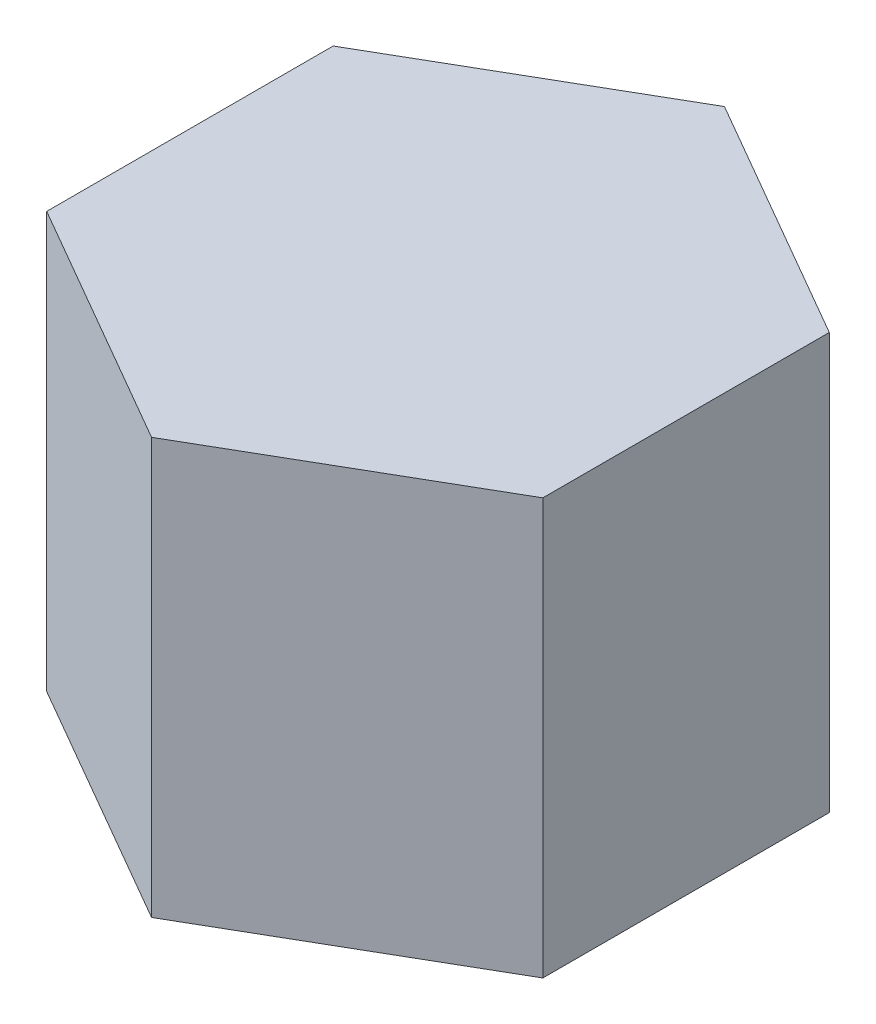
ISO-10303-21;
HEADER;
FILE_DESCRIPTION(('STEP AP214'),'2;1');
FILE_NAME('part.step','',(''),(''),'','','');
FILE_SCHEMA(('AUTOMOTIVE_DESIGN { 1 0 10303 214 1 1 1 1 }'));
ENDSEC;
DATA;
#1=APPLICATION_CONTEXT('core data for automotive mechanical design processes');
#2=APPLICATION_PROTOCOL_DEFINITION('international standard','automotive_design',2000,#1);
#3=PRODUCT_CONTEXT('',#1,'mechanical');
#4=PRODUCT('Part','Part','',(#3));
#5=PRODUCT_RELATED_PRODUCT_CATEGORY('part','',(#4));
#6=PRODUCT_DEFINITION_FORMATION('','',#4);
#7=PRODUCT_DEFINITION_CONTEXT('part definition',#1,'design');
#8=PRODUCT_DEFINITION('design','',#6,#7);
#9=PRODUCT_DEFINITION_SHAPE('','',#8);
#10=(LENGTH_UNIT() NAMED_UNIT(*) SI_UNIT(.MILLI.,.METRE.));
#11=(NAMED_UNIT(*) PLANE_ANGLE_UNIT() SI_UNIT($,.RADIAN.));
#12=(NAMED_UNIT(*) SI_UNIT($,.STERADIAN.) SOLID_ANGLE_UNIT());
#13=UNCERTAINTY_MEASURE_WITH_UNIT(LENGTH_MEASURE(1.E-05),#10,'distance_accuracy_value','');
#14=(GEOMETRIC_REPRESENTATION_CONTEXT(3) GLOBAL_UNCERTAINTY_ASSIGNED_CONTEXT((#13)) GLOBAL_UNIT_ASSIGNED_CONTEXT((#10,
#11,#12)) REPRESENTATION_CONTEXT('',''));
#15=CARTESIAN_POINT('',(0.,0.,0.));
#16=DIRECTION('',(0.,0.,1.));
#17=DIRECTION('',(1.,0.,0.));
#18=AXIS2_PLACEMENT_3D('',#15,#16,#17);
#19=CARTESIAN_POINT('',(206.642660308706,-148.537700895744,291.506971220494));
#20=DIRECTION('',(-0.499999999999943,0.,-0.866025403784472));
#21=DIRECTION('',(-0.866025403784472,0.,0.499999999999943));
#22=AXIS2_PLACEMENT_3D('',#19,#20,#21);
#23=PLANE('',#22);
#24=CARTESIAN_POINT('',(206.339551417382,-149.045793579175,291.681971220494));
#25=DIRECTION('',(0.866025403784471,0.,-0.499999999999943));
#26=VECTOR('',#25,1.);
#27=LINE('',#24,#26);
#28=CARTESIAN_POINT('',(206.339551417382,-149.045793579175,291.681971220494));
#29=VERTEX_POINT('',#28);
#30=CARTESIAN_POINT('',(206.642660308706,-149.045793579175,291.506971220494));
#31=VERTEX_POINT('',#30);
#32=EDGE_CURVE('E170',#29,#31,#27,.T.);
#33=ORIENTED_EDGE('',*,*,#32,.T.);
#34=CARTESIAN_POINT('',(206.642660308706,-148.537700895744,291.506971220494));
#35=DIRECTION('',(0.,-1.,0.));
#36=VECTOR('',#35,1.);
#37=LINE('',#34,#36);
#38=CARTESIAN_POINT('',(206.642660308706,-148.537700895744,291.506971220494));
#39=VERTEX_POINT('',#38);
#40=EDGE_CURVE('E35',#39,#31,#37,.T.);
#41=ORIENTED_EDGE('',*,*,#40,.F.);
#42=CARTESIAN_POINT('',(206.339551417382,-148.537700895744,291.681971220494));
#43=DIRECTION('',(0.866025403784471,0.,-0.499999999999943));
#44=VECTOR('',#43,1.);
#45=LINE('',#42,#44);
#46=CARTESIAN_POINT('',(206.339551417382,-148.537700895744,291.681971220494));
#47=VERTEX_POINT('',#46);
#48=EDGE_CURVE('E159',#47,#39,#45,.T.);
#49=ORIENTED_EDGE('',*,*,#48,.F.);
#50=CARTESIAN_POINT('',(206.339551417382,-148.537700895744,291.681971220494));
#51=DIRECTION('',(0.,-1.,0.));
#52=VECTOR('',#51,1.);
#53=LINE('',#50,#52);
#54=EDGE_CURVE('E10',#47,#29,#53,.T.);
#55=ORIENTED_EDGE('',*,*,#54,.T.);
#56=EDGE_LOOP('',(#33,#41,#49,#55));
#57=FACE_BOUND('',#56,.T.);
#58=ADVANCED_FACE('F16',(#57),#23,.F.);
#59=CARTESIAN_POINT('',(206.339551417382,-148.537700895744,291.681971220494));
#60=DIRECTION('',(0.499999999999943,0.,-0.866025403784472));
#61=DIRECTION('',(-0.866025403784472,0.,-0.499999999999943));
#62=AXIS2_PLACEMENT_3D('',#59,#60,#61);
#63=PLANE('',#62);
#64=CARTESIAN_POINT('',(206.036442526057,-149.045793579175,291.506971220494));
#65=DIRECTION('',(0.866025403784471,0.,0.499999999999943));
#66=VECTOR('',#65,1.);
#67=LINE('',#64,#66);
#68=CARTESIAN_POINT('',(206.036442526057,-149.045793579175,291.506971220494));
#69=VERTEX_POINT('',#68);
#70=EDGE_CURVE('E167',#69,#29,#67,.T.);
#71=ORIENTED_EDGE('',*,*,#70,.T.);
#72=ORIENTED_EDGE('',*,*,#54,.F.);
#73=CARTESIAN_POINT('',(206.036442526057,-148.537700895744,291.506971220494));
#74=DIRECTION('',(0.866025403784471,0.,0.499999999999943));
#75=VECTOR('',#74,1.);
#76=LINE('',#73,#75);
#77=CARTESIAN_POINT('',(206.036442526057,-148.537700895744,291.506971220494));
#78=VERTEX_POINT('',#77);
#79=EDGE_CURVE('E156',#78,#47,#76,.T.);
#80=ORIENTED_EDGE('',*,*,#79,.F.);
#81=CARTESIAN_POINT('',(206.036442526057,-148.537700895744,291.506971220494));
#82=DIRECTION('',(0.,-1.,0.));
#83=VECTOR('',#82,1.);
#84=LINE('',#81,#83);
#85=EDGE_CURVE('E27',#78,#69,#84,.T.);
#86=ORIENTED_EDGE('',*,*,#85,.T.);
#87=EDGE_LOOP('',(#71,#72,#80,#86));
#88=FACE_BOUND('',#87,.T.);
#89=ADVANCED_FACE('F189',(#88),#63,.F.);
#90=CARTESIAN_POINT('',(206.036442526057,-148.537700895744,290.831971220494));
#91=DIRECTION('',(1.,0.,0.));
#92=DIRECTION('',(0.,1.,0.));
#93=AXIS2_PLACEMENT_3D('',#90,#91,#92);
#94=PLANE('',#93);
#95=CARTESIAN_POINT('',(206.036442526057,-149.045793579175,291.156971220494));
#96=DIRECTION('',(0.,0.,1.));
#97=VECTOR('',#96,1.);
#98=LINE('',#95,#97);
#99=CARTESIAN_POINT('',(206.036442526057,-149.045793579175,291.156971220494));
#100=VERTEX_POINT('',#99);
#101=EDGE_CURVE('E163',#100,#69,#98,.T.);
#102=ORIENTED_EDGE('',*,*,#101,.T.);
#103=ORIENTED_EDGE('',*,*,#85,.F.);
#104=CARTESIAN_POINT('',(206.036442526057,-148.537700895744,291.156971220494));
#105=DIRECTION('',(0.,0.,1.));
#106=VECTOR('',#105,1.);
#107=LINE('',#104,#106);
#108=CARTESIAN_POINT('',(206.036442526057,-148.537700895744,291.156971220494));
#109=VERTEX_POINT('',#108);
#110=EDGE_CURVE('E106',#109,#78,#107,.T.);
#111=ORIENTED_EDGE('',*,*,#110,.F.);
#112=CARTESIAN_POINT('',(206.036442526057,-148.537700895744,291.156971220494));
#113=DIRECTION('',(0.,-1.,0.));
#114=VECTOR('',#113,1.);
#115=LINE('',#112,#114);
#116=EDGE_CURVE('E94',#109,#100,#115,.T.);
#117=ORIENTED_EDGE('',*,*,#116,.T.);
#118=EDGE_LOOP('',(#102,#103,#111,#117));
#119=FACE_BOUND('',#118,.T.);
#120=ADVANCED_FACE('F198',(#119),#94,.F.);
#121=CARTESIAN_POINT('',(206.036442526057,-148.537700895744,291.156971220494));
#122=DIRECTION('',(0.499999999999943,0.,0.866025403784472));
#123=DIRECTION('',(0.866025403784472,0.,-0.499999999999943));
#124=AXIS2_PLACEMENT_3D('',#121,#122,#123);
#125=PLANE('',#124);
#126=CARTESIAN_POINT('',(206.339551417382,-149.045793579175,290.981971220494));
#127=DIRECTION('',(-0.866025403784471,0.,0.499999999999943));
#128=VECTOR('',#127,1.);
#129=LINE('',#126,#128);
#130=CARTESIAN_POINT('',(206.339551417382,-149.045793579175,290.981971220494));
#131=VERTEX_POINT('',#130);
#132=EDGE_CURVE('E162',#131,#100,#129,.T.);
#133=ORIENTED_EDGE('',*,*,#132,.T.);
#134=ORIENTED_EDGE('',*,*,#116,.F.);
#135=CARTESIAN_POINT('',(206.339551417382,-148.537700895744,290.981971220494));
#136=DIRECTION('',(-0.866025403784471,0.,0.499999999999943));
#137=VECTOR('',#136,1.);
#138=LINE('',#135,#137);
#139=CARTESIAN_POINT('',(206.339551417382,-148.537700895744,290.981971220494));
#140=VERTEX_POINT('',#139);
#141=EDGE_CURVE('E98',#140,#109,#138,.T.);
#142=ORIENTED_EDGE('',*,*,#141,.F.);
#143=CARTESIAN_POINT('',(206.339551417382,-148.537700895744,290.981971220494));
#144=DIRECTION('',(0.,-1.,0.));
#145=VECTOR('',#144,1.);
#146=LINE('',#143,#145);
#147=EDGE_CURVE('E79',#140,#131,#146,.T.);
#148=ORIENTED_EDGE('',*,*,#147,.T.);
#149=EDGE_LOOP('',(#133,#134,#142,#148));
#150=FACE_BOUND('',#149,.T.);
#151=ADVANCED_FACE('F100',(#150),#125,.F.);
#152=CARTESIAN_POINT('',(206.339551417382,-148.537700895744,290.981971220494));
#153=DIRECTION('',(-0.500000000000062,0.,0.866025403784403));
#154=DIRECTION('',(0.866025403784403,0.,0.500000000000062));
#155=AXIS2_PLACEMENT_3D('',#152,#153,#154);
#156=PLANE('',#155);
#157=CARTESIAN_POINT('',(206.642660308706,-149.045793579175,291.156971220494));
#158=DIRECTION('',(-0.866025403784403,0.,-0.500000000000062));
#159=VECTOR('',#158,1.);
#160=LINE('',#157,#159);
#161=CARTESIAN_POINT('',(206.642660308706,-149.045793579175,291.156971220494));
#162=VERTEX_POINT('',#161);
#163=EDGE_CURVE('E88',#162,#131,#160,.T.);
#164=ORIENTED_EDGE('',*,*,#163,.T.);
#165=ORIENTED_EDGE('',*,*,#147,.F.);
#166=CARTESIAN_POINT('',(206.642660308706,-148.537700895744,291.156971220494));
#167=DIRECTION('',(-0.866025403784403,0.,-0.500000000000062));
#168=VECTOR('',#167,1.);
#169=LINE('',#166,#168);
#170=CARTESIAN_POINT('',(206.642660308706,-148.537700895744,291.156971220494));
#171=VERTEX_POINT('',#170);
#172=EDGE_CURVE('E84',#171,#140,#169,.T.);
#173=ORIENTED_EDGE('',*,*,#172,.F.);
#174=CARTESIAN_POINT('',(206.642660308706,-148.537700895744,291.156971220494));
#175=DIRECTION('',(0.,-1.,0.));
#176=VECTOR('',#175,1.);
#177=LINE('',#174,#176);
#178=EDGE_CURVE('E58',#171,#162,#177,.T.);
#179=ORIENTED_EDGE('',*,*,#178,.T.);
#180=EDGE_LOOP('',(#164,#165,#173,#179));
#181=FACE_BOUND('',#180,.T.);
#182=ADVANCED_FACE('F82',(#181),#156,.F.);
#183=CARTESIAN_POINT('',(206.642660308706,-148.537700895744,290.831971220494));
#184=DIRECTION('',(-1.,0.,0.));
#185=DIRECTION('',(0.,-1.,0.));
#186=AXIS2_PLACEMENT_3D('',#183,#184,#185);
#187=PLANE('',#186);
#188=CARTESIAN_POINT('',(206.642660308706,-149.045793579175,291.506971220494));
#189=DIRECTION('',(0.,0.,-1.));
#190=VECTOR('',#189,1.);
#191=LINE('',#188,#190);
#192=EDGE_CURVE('E160',#31,#162,#191,.T.);
#193=ORIENTED_EDGE('',*,*,#192,.T.);
#194=ORIENTED_EDGE('',*,*,#178,.F.);
#195=CARTESIAN_POINT('',(206.642660308706,-148.537700895744,291.506971220494));
#196=DIRECTION('',(0.,0.,-1.));
#197=VECTOR('',#196,1.);
#198=LINE('',#195,#197);
#199=EDGE_CURVE('E112',#39,#171,#198,.T.);
#200=ORIENTED_EDGE('',*,*,#199,.F.);
#201=ORIENTED_EDGE('',*,*,#40,.T.);
#202=EDGE_LOOP('',(#193,#194,#200,#201));
#203=FACE_BOUND('',#202,.T.);
#204=ADVANCED_FACE('F131',(#203),#187,.F.);
#205=CARTESIAN_POINT('',(206.339551417382,-148.537700895744,290.831971220494));
#206=DIRECTION('',(0.,-1.,0.));
#207=DIRECTION('',(1.,0.,0.));
#208=AXIS2_PLACEMENT_3D('',#205,#206,#207);
#209=PLANE('',#208);
#210=ORIENTED_EDGE('',*,*,#48,.T.);
#211=ORIENTED_EDGE('',*,*,#199,.T.);
#212=ORIENTED_EDGE('',*,*,#172,.T.);
#213=ORIENTED_EDGE('',*,*,#141,.T.);
#214=ORIENTED_EDGE('',*,*,#110,.T.);
#215=ORIENTED_EDGE('',*,*,#79,.T.);
#216=EDGE_LOOP('',(#210,#211,#212,#213,#214,#215));
#217=FACE_BOUND('',#216,.T.);
#218=ADVANCED_FACE('F111',(#217),#209,.F.);
#219=CARTESIAN_POINT('',(206.339551417382,-149.045793579175,290.831971220494));
#220=DIRECTION('',(0.,-1.,0.));
#221=DIRECTION('',(1.,0.,0.));
#222=AXIS2_PLACEMENT_3D('',#219,#220,#221);
#223=PLANE('',#222);
#224=ORIENTED_EDGE('',*,*,#32,.F.);
#225=ORIENTED_EDGE('',*,*,#70,.F.);
#226=ORIENTED_EDGE('',*,*,#101,.F.);
#227=ORIENTED_EDGE('',*,*,#132,.F.);
#228=ORIENTED_EDGE('',*,*,#163,.F.);
#229=ORIENTED_EDGE('',*,*,#192,.F.);
#230=EDGE_LOOP('',(#224,#225,#226,#227,#228,#229));
#231=FACE_BOUND('',#230,.T.);
#232=ADVANCED_FACE('F130',(#231),#223,.T.);
#233=CLOSED_SHELL('',(#58,#89,#120,#151,#182,#204,#218,#232));
#234=MANIFOLD_SOLID_BREP('B1',#233);
#235=ADVANCED_BREP_SHAPE_REPRESENTATION('',(#18,#234),#14);
#236=SHAPE_DEFINITION_REPRESENTATION(#9,#235);
ENDSEC;
END-ISO-10303-21;
